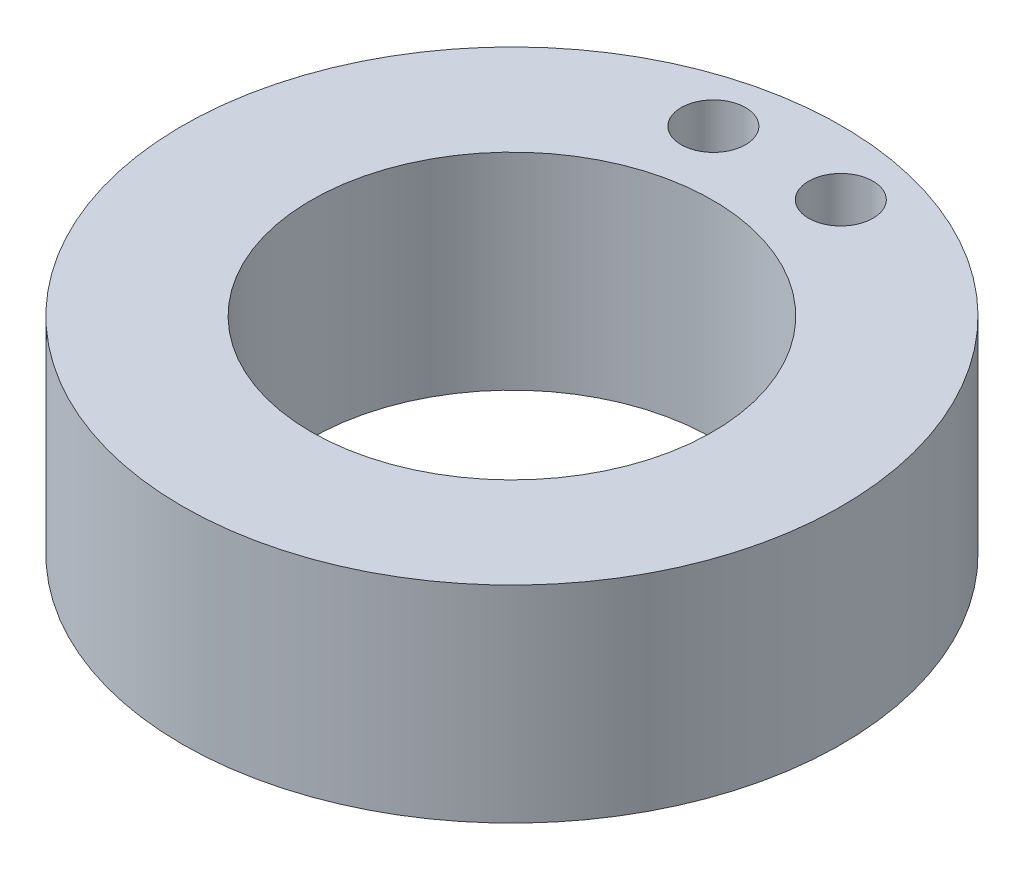
ISO-10303-21;
HEADER;
FILE_DESCRIPTION(('STEP AP214'),'2;1');
FILE_NAME('part.step','',(''),(''),'','','');
FILE_SCHEMA(('AUTOMOTIVE_DESIGN { 1 0 10303 214 1 1 1 1 }'));
ENDSEC;
DATA;
#1=APPLICATION_CONTEXT('core data for automotive mechanical design processes');
#2=APPLICATION_PROTOCOL_DEFINITION('international standard','automotive_design',2000,#1);
#3=PRODUCT_CONTEXT('',#1,'mechanical');
#4=PRODUCT('Part','Part','',(#3));
#5=PRODUCT_RELATED_PRODUCT_CATEGORY('part','',(#4));
#6=PRODUCT_DEFINITION_FORMATION('','',#4);
#7=PRODUCT_DEFINITION_CONTEXT('part definition',#1,'design');
#8=PRODUCT_DEFINITION('design','',#6,#7);
#9=PRODUCT_DEFINITION_SHAPE('','',#8);
#10=(LENGTH_UNIT() NAMED_UNIT(*) SI_UNIT(.MILLI.,.METRE.));
#11=(NAMED_UNIT(*) PLANE_ANGLE_UNIT() SI_UNIT($,.RADIAN.));
#12=(NAMED_UNIT(*) SI_UNIT($,.STERADIAN.) SOLID_ANGLE_UNIT());
#13=UNCERTAINTY_MEASURE_WITH_UNIT(LENGTH_MEASURE(1.E-05),#10,'distance_accuracy_value','');
#14=(GEOMETRIC_REPRESENTATION_CONTEXT(3) GLOBAL_UNCERTAINTY_ASSIGNED_CONTEXT((#13)) GLOBAL_UNIT_ASSIGNED_CONTEXT((#10,
#11,#12)) REPRESENTATION_CONTEXT('',''));
#15=CARTESIAN_POINT('',(0.,0.,0.));
#16=DIRECTION('',(0.,0.,1.));
#17=DIRECTION('',(1.,0.,0.));
#18=AXIS2_PLACEMENT_3D('',#15,#16,#17);
#19=CARTESIAN_POINT('',(0.,10.16,0.));
#20=DIRECTION('',(0.,1.,0.));
#21=DIRECTION('',(0.,0.,1.));
#22=AXIS2_PLACEMENT_3D('',#19,#20,#21);
#23=PLANE('',#22);
#24=CARTESIAN_POINT('',(3.14031560361627,10.16,-13.0683));
#25=DIRECTION('',(0.,1.,0.));
#26=DIRECTION('',(0.,0.,1.));
#27=AXIS2_PLACEMENT_3D('',#24,#25,#26);
#28=CIRCLE('',#27,1.5875);
#29=CARTESIAN_POINT('',(3.14031560361627,10.16,-11.4808));
#30=VERTEX_POINT('',#29);
#31=EDGE_CURVE('E64',#30,#30,#28,.F.);
#32=ORIENTED_EDGE('',*,*,#31,.T.);
#33=EDGE_LOOP('',(#32));
#34=FACE_BOUND('',#33,.T.);
#35=CARTESIAN_POINT('',(0.,10.16,0.));
#36=DIRECTION('',(0.,1.,0.));
#37=DIRECTION('',(0.,0.,1.));
#38=AXIS2_PLACEMENT_3D('',#35,#36,#37);
#39=CIRCLE('',#38,16.2433);
#40=CARTESIAN_POINT('',(0.,10.16,16.2433));
#41=VERTEX_POINT('',#40);
#42=EDGE_CURVE('E41',#41,#41,#39,.T.);
#43=ORIENTED_EDGE('',*,*,#42,.T.);
#44=EDGE_LOOP('',(#43));
#45=FACE_BOUND('',#44,.T.);
#46=CARTESIAN_POINT('',(0.,10.16,0.));
#47=DIRECTION('',(0.,1.,0.));
#48=DIRECTION('',(0.,0.,1.));
#49=AXIS2_PLACEMENT_3D('',#46,#47,#48);
#50=CIRCLE('',#49,9.89329999999999);
#51=CARTESIAN_POINT('',(0.,10.16,9.89329999999999));
#52=VERTEX_POINT('',#51);
#53=EDGE_CURVE('E10',#52,#52,#50,.T.);
#54=ORIENTED_EDGE('',*,*,#53,.F.);
#55=EDGE_LOOP('',(#54));
#56=FACE_BOUND('',#55,.T.);
#57=CARTESIAN_POINT('',(-3.14031560361627,10.16,-13.0683));
#58=DIRECTION('',(0.,1.,0.));
#59=DIRECTION('',(0.,0.,1.));
#60=AXIS2_PLACEMENT_3D('',#57,#58,#59);
#61=CIRCLE('',#60,1.5875);
#62=CARTESIAN_POINT('',(-3.14031560361627,10.16,-11.4808));
#63=VERTEX_POINT('',#62);
#64=EDGE_CURVE('E55',#63,#63,#61,.T.);
#65=ORIENTED_EDGE('',*,*,#64,.F.);
#66=EDGE_LOOP('',(#65));
#67=FACE_BOUND('',#66,.T.);
#68=ADVANCED_FACE('F33',(#34,#45,#56,#67),#23,.T.);
#69=CARTESIAN_POINT('',(0.,0.,0.));
#70=DIRECTION('',(0.,1.,0.));
#71=DIRECTION('',(0.,0.,1.));
#72=AXIS2_PLACEMENT_3D('',#69,#70,#71);
#73=PLANE('',#72);
#74=CARTESIAN_POINT('',(0.,0.,0.));
#75=DIRECTION('',(0.,1.,0.));
#76=DIRECTION('',(0.,0.,1.));
#77=AXIS2_PLACEMENT_3D('',#74,#75,#76);
#78=CIRCLE('',#77,9.89329999999999);
#79=CARTESIAN_POINT('',(0.,0.,9.89329999999999));
#80=VERTEX_POINT('',#79);
#81=EDGE_CURVE('E37',#80,#80,#78,.T.);
#82=ORIENTED_EDGE('',*,*,#81,.T.);
#83=EDGE_LOOP('',(#82));
#84=FACE_BOUND('',#83,.T.);
#85=CARTESIAN_POINT('',(0.,0.,0.));
#86=DIRECTION('',(0.,1.,0.));
#87=DIRECTION('',(0.,0.,1.));
#88=AXIS2_PLACEMENT_3D('',#85,#86,#87);
#89=CIRCLE('',#88,16.2433);
#90=CARTESIAN_POINT('',(0.,0.,16.2433));
#91=VERTEX_POINT('',#90);
#92=EDGE_CURVE('E48',#91,#91,#89,.T.);
#93=ORIENTED_EDGE('',*,*,#92,.F.);
#94=EDGE_LOOP('',(#93));
#95=FACE_BOUND('',#94,.T.);
#96=CARTESIAN_POINT('',(3.14031560361627,0.,-13.0683));
#97=DIRECTION('',(0.,1.,0.));
#98=DIRECTION('',(0.,0.,1.));
#99=AXIS2_PLACEMENT_3D('',#96,#97,#98);
#100=CIRCLE('',#99,1.5875);
#101=CARTESIAN_POINT('',(3.14031560361627,0.,-11.4808));
#102=VERTEX_POINT('',#101);
#103=EDGE_CURVE('E60',#102,#102,#100,.F.);
#104=ORIENTED_EDGE('',*,*,#103,.F.);
#105=EDGE_LOOP('',(#104));
#106=FACE_BOUND('',#105,.T.);
#107=CARTESIAN_POINT('',(-3.14031560361627,0.,-13.0683));
#108=DIRECTION('',(0.,1.,0.));
#109=DIRECTION('',(0.,0.,1.));
#110=AXIS2_PLACEMENT_3D('',#107,#108,#109);
#111=CIRCLE('',#110,1.5875);
#112=CARTESIAN_POINT('',(-3.14031560361627,0.,-11.4808));
#113=VERTEX_POINT('',#112);
#114=EDGE_CURVE('E50',#113,#113,#111,.T.);
#115=ORIENTED_EDGE('',*,*,#114,.T.);
#116=EDGE_LOOP('',(#115));
#117=FACE_BOUND('',#116,.T.);
#118=ADVANCED_FACE('F84',(#84,#95,#106,#117),#73,.F.);
#119=CARTESIAN_POINT('',(0.,10.16,0.));
#120=DIRECTION('',(0.,-1.,0.));
#121=DIRECTION('',(0.,0.,-1.));
#122=AXIS2_PLACEMENT_3D('',#119,#120,#121);
#123=CYLINDRICAL_SURFACE('',#122,16.2433);
#124=ORIENTED_EDGE('',*,*,#42,.F.);
#125=EDGE_LOOP('',(#124));
#126=FACE_BOUND('',#125,.T.);
#127=ORIENTED_EDGE('',*,*,#92,.T.);
#128=EDGE_LOOP('',(#127));
#129=FACE_BOUND('',#128,.T.);
#130=ADVANCED_FACE('F35',(#126,#129),#123,.T.);
#131=CARTESIAN_POINT('',(0.,10.16,0.));
#132=DIRECTION('',(0.,-1.,0.));
#133=DIRECTION('',(0.,0.,-1.));
#134=AXIS2_PLACEMENT_3D('',#131,#132,#133);
#135=CYLINDRICAL_SURFACE('',#134,9.89329999999999);
#136=ORIENTED_EDGE('',*,*,#53,.T.);
#137=EDGE_LOOP('',(#136));
#138=FACE_BOUND('',#137,.T.);
#139=ORIENTED_EDGE('',*,*,#81,.F.);
#140=EDGE_LOOP('',(#139));
#141=FACE_BOUND('',#140,.T.);
#142=ADVANCED_FACE('F73',(#138,#141),#135,.F.);
#143=CARTESIAN_POINT('',(3.14031560361627,0.,-13.0683));
#144=DIRECTION('',(0.,1.,0.));
#145=DIRECTION('',(0.,0.,1.));
#146=AXIS2_PLACEMENT_3D('',#143,#144,#145);
#147=CYLINDRICAL_SURFACE('',#146,1.5875);
#148=ORIENTED_EDGE('',*,*,#103,.T.);
#149=EDGE_LOOP('',(#148));
#150=FACE_BOUND('',#149,.T.);
#151=ORIENTED_EDGE('',*,*,#31,.F.);
#152=EDGE_LOOP('',(#151));
#153=FACE_BOUND('',#152,.T.);
#154=ADVANCED_FACE('F70',(#150,#153),#147,.F.);
#155=CARTESIAN_POINT('',(-3.14031560361627,0.,-13.0683));
#156=DIRECTION('',(0.,1.,0.));
#157=DIRECTION('',(0.,0.,1.));
#158=AXIS2_PLACEMENT_3D('',#155,#156,#157);
#159=CYLINDRICAL_SURFACE('',#158,1.5875);
#160=ORIENTED_EDGE('',*,*,#114,.F.);
#161=EDGE_LOOP('',(#160));
#162=FACE_BOUND('',#161,.T.);
#163=ORIENTED_EDGE('',*,*,#64,.T.);
#164=EDGE_LOOP('',(#163));
#165=FACE_BOUND('',#164,.T.);
#166=ADVANCED_FACE('F72',(#162,#165),#159,.F.);
#167=CLOSED_SHELL('',(#68,#118,#130,#142,#154,#166));
#168=MANIFOLD_SOLID_BREP('B2',#167);
#169=ADVANCED_BREP_SHAPE_REPRESENTATION('',(#18,#168),#14);
#170=SHAPE_DEFINITION_REPRESENTATION(#9,#169);
ENDSEC;
END-ISO-10303-21;
